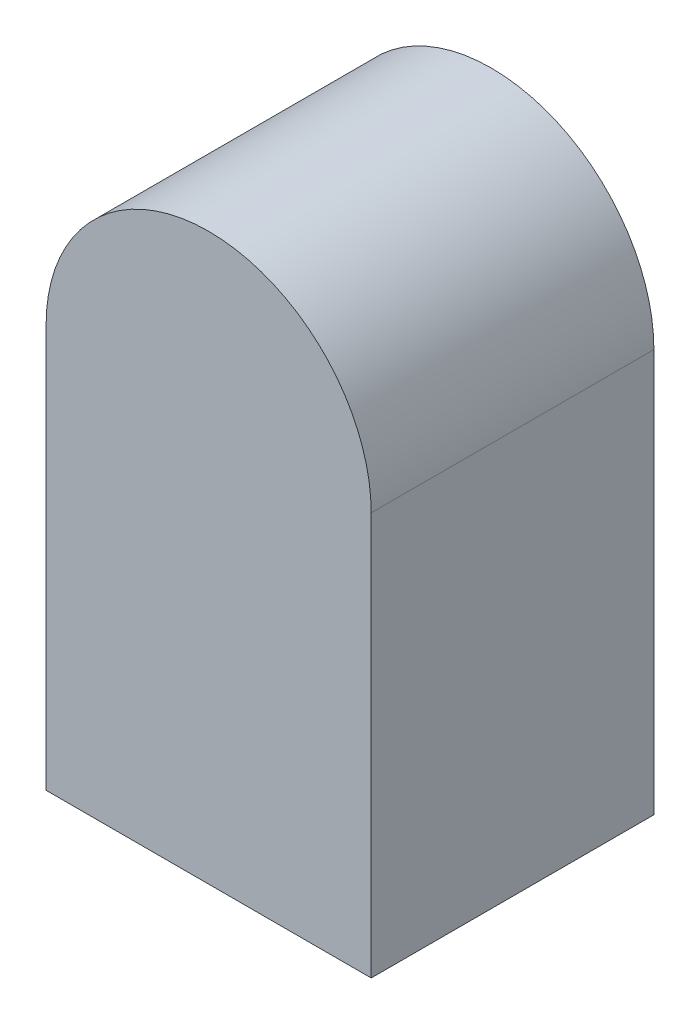
ISO-10303-21;
HEADER;
FILE_DESCRIPTION(('STEP AP214'),'2;1');
FILE_NAME('part.step','',(''),(''),'','','');
FILE_SCHEMA(('AUTOMOTIVE_DESIGN { 1 0 10303 214 1 1 1 1 }'));
ENDSEC;
DATA;
#1=APPLICATION_CONTEXT('core data for automotive mechanical design processes');
#2=APPLICATION_PROTOCOL_DEFINITION('international standard','automotive_design',2000,#1);
#3=PRODUCT_CONTEXT('',#1,'mechanical');
#4=PRODUCT('Part','Part','',(#3));
#5=PRODUCT_RELATED_PRODUCT_CATEGORY('part','',(#4));
#6=PRODUCT_DEFINITION_FORMATION('','',#4);
#7=PRODUCT_DEFINITION_CONTEXT('part definition',#1,'design');
#8=PRODUCT_DEFINITION('design','',#6,#7);
#9=PRODUCT_DEFINITION_SHAPE('','',#8);
#10=(LENGTH_UNIT() NAMED_UNIT(*) SI_UNIT(.MILLI.,.METRE.));
#11=(NAMED_UNIT(*) PLANE_ANGLE_UNIT() SI_UNIT($,.RADIAN.));
#12=(NAMED_UNIT(*) SI_UNIT($,.STERADIAN.) SOLID_ANGLE_UNIT());
#13=UNCERTAINTY_MEASURE_WITH_UNIT(LENGTH_MEASURE(1.E-05),#10,'distance_accuracy_value','');
#14=(GEOMETRIC_REPRESENTATION_CONTEXT(3) GLOBAL_UNCERTAINTY_ASSIGNED_CONTEXT((#13)) GLOBAL_UNIT_ASSIGNED_CONTEXT((#10,
#11,#12)) REPRESENTATION_CONTEXT('',''));
#15=CARTESIAN_POINT('',(0.,0.,0.));
#16=DIRECTION('',(0.,0.,1.));
#17=DIRECTION('',(1.,0.,0.));
#18=AXIS2_PLACEMENT_3D('',#15,#16,#17);
#19=CARTESIAN_POINT('',(1.75,-2.8335240809167,0.2));
#20=DIRECTION('',(0.,0.,1.));
#21=DIRECTION('',(1.,0.,0.));
#22=AXIS2_PLACEMENT_3D('',#19,#20,#21);
#23=PLANE('',#22);
#24=DIRECTION('',(0.,-1.,0.));
#25=VECTOR('',#24,1.);
#26=CARTESIAN_POINT('',(1.635,-2.715,0.2));
#27=LINE('',#26,#25);
#28=CARTESIAN_POINT('',(1.635,-2.715,0.2));
#29=VERTEX_POINT('',#28);
#30=CARTESIAN_POINT('',(1.635,-3.,0.2));
#31=VERTEX_POINT('',#30);
#32=EDGE_CURVE('E11',#29,#31,#27,.T.);
#33=ORIENTED_EDGE('',*,*,#32,.T.);
#34=DIRECTION('',(1.,0.,0.));
#35=VECTOR('',#34,1.);
#36=CARTESIAN_POINT('',(-0.625,-3.,0.2));
#37=LINE('',#36,#35);
#38=CARTESIAN_POINT('',(1.865,-3.,0.2));
#39=VERTEX_POINT('',#38);
#40=EDGE_CURVE('E24',#31,#39,#37,.T.);
#41=ORIENTED_EDGE('',*,*,#40,.T.);
#42=DIRECTION('',(0.,1.,0.));
#43=VECTOR('',#42,1.);
#44=CARTESIAN_POINT('',(1.865,-3.,0.2));
#45=LINE('',#44,#43);
#46=CARTESIAN_POINT('',(1.865,-2.715,0.2));
#47=VERTEX_POINT('',#46);
#48=EDGE_CURVE('E88',#39,#47,#45,.T.);
#49=ORIENTED_EDGE('',*,*,#48,.T.);
#50=CARTESIAN_POINT('',(1.75,-2.715,0.2));
#51=DIRECTION('',(0.,0.,1.));
#52=DIRECTION('',(1.,0.,0.));
#53=AXIS2_PLACEMENT_3D('',#50,#51,#52);
#54=CIRCLE('',#53,0.115);
#55=EDGE_CURVE('E70',#47,#29,#54,.T.);
#56=ORIENTED_EDGE('',*,*,#55,.T.);
#57=EDGE_LOOP('',(#33,#41,#49,#56));
#58=FACE_BOUND('',#57,.T.);
#59=ADVANCED_FACE('F17',(#58),#23,.T.);
#60=CARTESIAN_POINT('',(-3.,-3.,0.));
#61=DIRECTION('',(0.,-1.,0.));
#62=DIRECTION('',(1.,0.,0.));
#63=AXIS2_PLACEMENT_3D('',#60,#61,#62);
#64=PLANE('',#63);
#65=DIRECTION('',(0.,0.,-1.));
#66=VECTOR('',#65,1.);
#67=CARTESIAN_POINT('',(1.865,-3.,0.));
#68=LINE('',#67,#66);
#69=CARTESIAN_POINT('',(1.865,-3.,0.));
#70=VERTEX_POINT('',#69);
#71=EDGE_CURVE('E76',#39,#70,#68,.T.);
#72=ORIENTED_EDGE('',*,*,#71,.F.);
#73=ORIENTED_EDGE('',*,*,#40,.F.);
#74=DIRECTION('',(0.,0.,1.));
#75=VECTOR('',#74,1.);
#76=CARTESIAN_POINT('',(1.635,-3.,0.));
#77=LINE('',#76,#75);
#78=CARTESIAN_POINT('',(1.635,-3.,0.));
#79=VERTEX_POINT('',#78);
#80=EDGE_CURVE('E84',#79,#31,#77,.T.);
#81=ORIENTED_EDGE('',*,*,#80,.F.);
#82=DIRECTION('',(1.,0.,0.));
#83=VECTOR('',#82,1.);
#84=CARTESIAN_POINT('',(1.635,-3.,0.));
#85=LINE('',#84,#83);
#86=EDGE_CURVE('E82',#79,#70,#85,.T.);
#87=ORIENTED_EDGE('',*,*,#86,.T.);
#88=EDGE_LOOP('',(#72,#73,#81,#87));
#89=FACE_BOUND('',#88,.T.);
#90=ADVANCED_FACE('F90',(#89),#64,.T.);
#91=CARTESIAN_POINT('',(1.635,-2.715,0.));
#92=DIRECTION('',(-1.,0.,0.));
#93=DIRECTION('',(0.,-1.,0.));
#94=AXIS2_PLACEMENT_3D('',#91,#92,#93);
#95=PLANE('',#94);
#96=DIRECTION('',(0.,-1.,0.));
#97=VECTOR('',#96,1.);
#98=CARTESIAN_POINT('',(1.635,-2.715,0.));
#99=LINE('',#98,#97);
#100=CARTESIAN_POINT('',(1.635,-2.715,0.));
#101=VERTEX_POINT('',#100);
#102=EDGE_CURVE('E61',#101,#79,#99,.T.);
#103=ORIENTED_EDGE('',*,*,#102,.T.);
#104=ORIENTED_EDGE('',*,*,#80,.T.);
#105=ORIENTED_EDGE('',*,*,#32,.F.);
#106=DIRECTION('',(0.,0.,1.));
#107=VECTOR('',#106,1.);
#108=CARTESIAN_POINT('',(1.635,-2.715,0.));
#109=LINE('',#108,#107);
#110=EDGE_CURVE('E64',#101,#29,#109,.T.);
#111=ORIENTED_EDGE('',*,*,#110,.F.);
#112=EDGE_LOOP('',(#103,#104,#105,#111));
#113=FACE_BOUND('',#112,.T.);
#114=ADVANCED_FACE('F91',(#113),#95,.T.);
#115=CARTESIAN_POINT('',(1.75,-2.715,0.));
#116=DIRECTION('',(0.,0.,1.));
#117=DIRECTION('',(1.,0.,0.));
#118=AXIS2_PLACEMENT_3D('',#115,#116,#117);
#119=CYLINDRICAL_SURFACE('',#118,0.115);
#120=CARTESIAN_POINT('',(1.75,-2.715,0.));
#121=DIRECTION('',(0.,0.,1.));
#122=DIRECTION('',(1.,0.,0.));
#123=AXIS2_PLACEMENT_3D('',#120,#121,#122);
#124=CIRCLE('',#123,0.115);
#125=CARTESIAN_POINT('',(1.865,-2.715,0.));
#126=VERTEX_POINT('',#125);
#127=EDGE_CURVE('E54',#126,#101,#124,.T.);
#128=ORIENTED_EDGE('',*,*,#127,.T.);
#129=ORIENTED_EDGE('',*,*,#110,.T.);
#130=ORIENTED_EDGE('',*,*,#55,.F.);
#131=DIRECTION('',(0.,0.,1.));
#132=VECTOR('',#131,1.);
#133=CARTESIAN_POINT('',(1.865,-2.715,0.));
#134=LINE('',#133,#132);
#135=EDGE_CURVE('E65',#126,#47,#134,.T.);
#136=ORIENTED_EDGE('',*,*,#135,.F.);
#137=EDGE_LOOP('',(#128,#129,#130,#136));
#138=FACE_BOUND('',#137,.T.);
#139=ADVANCED_FACE('F69',(#138),#119,.T.);
#140=CARTESIAN_POINT('',(1.865,-3.,0.));
#141=DIRECTION('',(1.,0.,0.));
#142=DIRECTION('',(0.,1.,0.));
#143=AXIS2_PLACEMENT_3D('',#140,#141,#142);
#144=PLANE('',#143);
#145=DIRECTION('',(0.,1.,0.));
#146=VECTOR('',#145,1.);
#147=CARTESIAN_POINT('',(1.865,-3.,0.));
#148=LINE('',#147,#146);
#149=EDGE_CURVE('E59',#70,#126,#148,.T.);
#150=ORIENTED_EDGE('',*,*,#149,.T.);
#151=ORIENTED_EDGE('',*,*,#135,.T.);
#152=ORIENTED_EDGE('',*,*,#48,.F.);
#153=ORIENTED_EDGE('',*,*,#71,.T.);
#154=EDGE_LOOP('',(#150,#151,#152,#153));
#155=FACE_BOUND('',#154,.T.);
#156=ADVANCED_FACE('F74',(#155),#144,.T.);
#157=CARTESIAN_POINT('',(1.75,-2.8335265642716,0.));
#158=DIRECTION('',(0.,0.,1.));
#159=DIRECTION('',(0.,1.,0.));
#160=AXIS2_PLACEMENT_3D('',#157,#158,#159);
#161=PLANE('',#160);
#162=ORIENTED_EDGE('',*,*,#86,.F.);
#163=ORIENTED_EDGE('',*,*,#102,.F.);
#164=ORIENTED_EDGE('',*,*,#127,.F.);
#165=ORIENTED_EDGE('',*,*,#149,.F.);
#166=EDGE_LOOP('',(#162,#163,#164,#165));
#167=FACE_BOUND('',#166,.T.);
#168=ADVANCED_FACE('F57',(#167),#161,.F.);
#169=CLOSED_SHELL('',(#59,#90,#114,#139,#156,#168));
#170=MANIFOLD_SOLID_BREP('B1',#169);
#171=ADVANCED_BREP_SHAPE_REPRESENTATION('',(#18,#170),#14);
#172=SHAPE_DEFINITION_REPRESENTATION(#9,#171);
ENDSEC;
END-ISO-10303-21;
